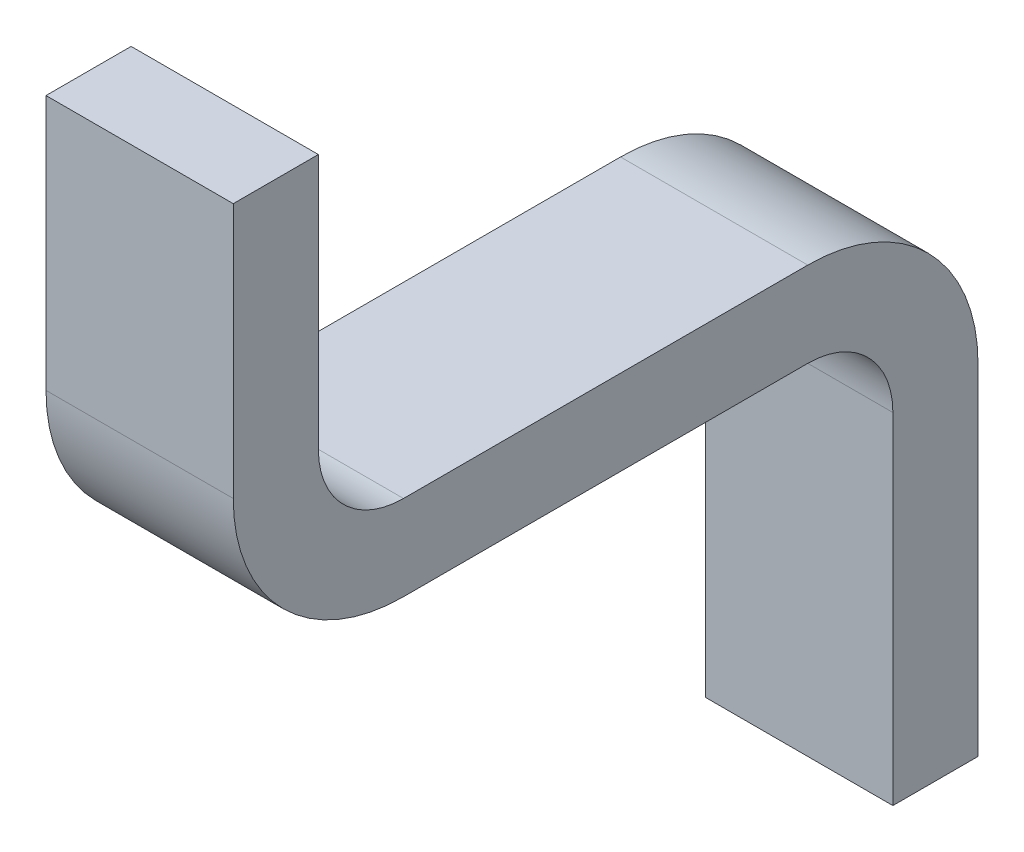
ISO-10303-21;
HEADER;
FILE_DESCRIPTION(('STEP AP214'),'2;1');
FILE_NAME('part.step','',(''),(''),'','','');
FILE_SCHEMA(('AUTOMOTIVE_DESIGN { 1 0 10303 214 1 1 1 1 }'));
ENDSEC;
DATA;
#1=APPLICATION_CONTEXT('core data for automotive mechanical design processes');
#2=APPLICATION_PROTOCOL_DEFINITION('international standard','automotive_design',2000,#1);
#3=PRODUCT_CONTEXT('',#1,'mechanical');
#4=PRODUCT('Part','Part','',(#3));
#5=PRODUCT_RELATED_PRODUCT_CATEGORY('part','',(#4));
#6=PRODUCT_DEFINITION_FORMATION('','',#4);
#7=PRODUCT_DEFINITION_CONTEXT('part definition',#1,'design');
#8=PRODUCT_DEFINITION('design','',#6,#7);
#9=PRODUCT_DEFINITION_SHAPE('','',#8);
#10=(LENGTH_UNIT() NAMED_UNIT(*) SI_UNIT(.MILLI.,.METRE.));
#11=(NAMED_UNIT(*) PLANE_ANGLE_UNIT() SI_UNIT($,.RADIAN.));
#12=(NAMED_UNIT(*) SI_UNIT($,.STERADIAN.) SOLID_ANGLE_UNIT());
#13=UNCERTAINTY_MEASURE_WITH_UNIT(LENGTH_MEASURE(1.E-05),#10,'distance_accuracy_value','');
#14=(GEOMETRIC_REPRESENTATION_CONTEXT(3) GLOBAL_UNCERTAINTY_ASSIGNED_CONTEXT((#13)) GLOBAL_UNIT_ASSIGNED_CONTEXT((#10,
#11,#12)) REPRESENTATION_CONTEXT('',''));
#15=CARTESIAN_POINT('',(0.,0.,0.));
#16=DIRECTION('',(0.,0.,1.));
#17=DIRECTION('',(1.,0.,0.));
#18=AXIS2_PLACEMENT_3D('',#15,#16,#17);
#19=CARTESIAN_POINT('',(-2.36,-4.,0.675));
#20=DIRECTION('',(1.,0.,0.));
#21=DIRECTION('',(0.,1.,0.));
#22=AXIS2_PLACEMENT_3D('',#19,#20,#21);
#23=PLANE('',#22);
#24=CARTESIAN_POINT('',(-2.36,-3.8,0.675));
#25=DIRECTION('',(-1.,0.,0.));
#26=DIRECTION('',(0.,-1.,0.));
#27=AXIS2_PLACEMENT_3D('',#24,#25,#26);
#28=CIRCLE('',#27,0.2);
#29=CARTESIAN_POINT('',(-2.36,-3.8,0.875));
#30=VERTEX_POINT('',#29);
#31=CARTESIAN_POINT('',(-2.36,-4.,0.675));
#32=VERTEX_POINT('',#31);
#33=EDGE_CURVE('E150',#30,#32,#28,.F.);
#34=ORIENTED_EDGE('',*,*,#33,.F.);
#35=DIRECTION('',(0.,1.,0.));
#36=VECTOR('',#35,1.);
#37=CARTESIAN_POINT('',(-2.36,-3.5,0.875));
#38=LINE('',#37,#36);
#39=CARTESIAN_POINT('',(-2.36,-3.5,0.875));
#40=VERTEX_POINT('',#39);
#41=EDGE_CURVE('E147',#30,#40,#38,.T.);
#42=ORIENTED_EDGE('',*,*,#41,.T.);
#43=DIRECTION('',(0.,0.,1.));
#44=VECTOR('',#43,1.);
#45=CARTESIAN_POINT('',(-2.36,-3.5,0.775));
#46=LINE('',#45,#44);
#47=CARTESIAN_POINT('',(-2.36,-3.5,0.775));
#48=VERTEX_POINT('',#47);
#49=EDGE_CURVE('E141',#48,#40,#46,.T.);
#50=ORIENTED_EDGE('',*,*,#49,.F.);
#51=DIRECTION('',(0.,1.,0.));
#52=VECTOR('',#51,1.);
#53=CARTESIAN_POINT('',(-2.36,-3.5,0.775));
#54=LINE('',#53,#52);
#55=CARTESIAN_POINT('',(-2.36,-3.8,0.775));
#56=VERTEX_POINT('',#55);
#57=EDGE_CURVE('E115',#48,#56,#54,.F.);
#58=ORIENTED_EDGE('',*,*,#57,.T.);
#59=CARTESIAN_POINT('',(-2.36,-3.8,0.675));
#60=DIRECTION('',(-1.,0.,0.));
#61=DIRECTION('',(0.,-1.,0.));
#62=AXIS2_PLACEMENT_3D('',#59,#60,#61);
#63=CIRCLE('',#62,0.1);
#64=CARTESIAN_POINT('',(-2.36,-3.9,0.675));
#65=VERTEX_POINT('',#64);
#66=EDGE_CURVE('E215',#56,#65,#63,.F.);
#67=ORIENTED_EDGE('',*,*,#66,.T.);
#68=DIRECTION('',(0.,0.,1.));
#69=VECTOR('',#68,1.);
#70=CARTESIAN_POINT('',(-2.36,-3.9,0.675));
#71=LINE('',#70,#69);
#72=CARTESIAN_POINT('',(-2.36,-3.9,0.2));
#73=VERTEX_POINT('',#72);
#74=EDGE_CURVE('E181',#65,#73,#71,.F.);
#75=ORIENTED_EDGE('',*,*,#74,.T.);
#76=CARTESIAN_POINT('',(-2.36,-4.1,0.2));
#77=DIRECTION('',(1.,0.,0.));
#78=DIRECTION('',(0.,1.,0.));
#79=AXIS2_PLACEMENT_3D('',#76,#77,#78);
#80=CIRCLE('',#79,0.2);
#81=CARTESIAN_POINT('',(-2.36,-4.1,0.));
#82=VERTEX_POINT('',#81);
#83=EDGE_CURVE('E20',#82,#73,#80,.T.);
#84=ORIENTED_EDGE('',*,*,#83,.F.);
#85=DIRECTION('',(0.,1.,0.));
#86=VECTOR('',#85,1.);
#87=CARTESIAN_POINT('',(-2.36,-4.1,0.));
#88=LINE('',#87,#86);
#89=CARTESIAN_POINT('',(-2.36,-4.5,0.));
#90=VERTEX_POINT('',#89);
#91=EDGE_CURVE('E91',#82,#90,#88,.F.);
#92=ORIENTED_EDGE('',*,*,#91,.T.);
#93=DIRECTION('',(0.,0.,1.));
#94=VECTOR('',#93,1.);
#95=CARTESIAN_POINT('',(-2.36,-4.5,0.));
#96=LINE('',#95,#94);
#97=CARTESIAN_POINT('',(-2.36,-4.5,0.1));
#98=VERTEX_POINT('',#97);
#99=EDGE_CURVE('E163',#90,#98,#96,.T.);
#100=ORIENTED_EDGE('',*,*,#99,.T.);
#101=DIRECTION('',(0.,1.,0.));
#102=VECTOR('',#101,1.);
#103=CARTESIAN_POINT('',(-2.36,-4.1,0.1));
#104=LINE('',#103,#102);
#105=CARTESIAN_POINT('',(-2.36,-4.1,0.1));
#106=VERTEX_POINT('',#105);
#107=EDGE_CURVE('E159',#98,#106,#104,.T.);
#108=ORIENTED_EDGE('',*,*,#107,.T.);
#109=CARTESIAN_POINT('',(-2.36,-4.1,0.2));
#110=DIRECTION('',(1.,0.,0.));
#111=DIRECTION('',(0.,1.,0.));
#112=AXIS2_PLACEMENT_3D('',#109,#110,#111);
#113=CIRCLE('',#112,0.1);
#114=CARTESIAN_POINT('',(-2.36,-4.,0.2));
#115=VERTEX_POINT('',#114);
#116=EDGE_CURVE('E155',#106,#115,#113,.T.);
#117=ORIENTED_EDGE('',*,*,#116,.T.);
#118=DIRECTION('',(0.,0.,1.));
#119=VECTOR('',#118,1.);
#120=CARTESIAN_POINT('',(-2.36,-4.,0.675));
#121=LINE('',#120,#119);
#122=EDGE_CURVE('E154',#115,#32,#121,.T.);
#123=ORIENTED_EDGE('',*,*,#122,.T.);
#124=EDGE_LOOP('',(#34,#42,#50,#58,#67,#75,#84,#92,#100,#108,#117,#123));
#125=FACE_BOUND('',#124,.T.);
#126=ADVANCED_FACE('F17',(#125),#23,.F.);
#127=CARTESIAN_POINT('',(-2.36,-4.1,0.2));
#128=DIRECTION('',(1.,0.,0.));
#129=DIRECTION('',(0.,1.,0.));
#130=AXIS2_PLACEMENT_3D('',#127,#128,#129);
#131=CYLINDRICAL_SURFACE('',#130,0.2);
#132=CARTESIAN_POINT('',(-2.14,-4.1,0.2));
#133=DIRECTION('',(1.,0.,0.));
#134=DIRECTION('',(0.,1.,0.));
#135=AXIS2_PLACEMENT_3D('',#132,#133,#134);
#136=CIRCLE('',#135,0.2);
#137=CARTESIAN_POINT('',(-2.14,-3.9,0.2));
#138=VERTEX_POINT('',#137);
#139=CARTESIAN_POINT('',(-2.14,-4.1,0.));
#140=VERTEX_POINT('',#139);
#141=EDGE_CURVE('E183',#138,#140,#136,.F.);
#142=ORIENTED_EDGE('',*,*,#141,.T.);
#143=DIRECTION('',(1.,0.,0.));
#144=VECTOR('',#143,1.);
#145=CARTESIAN_POINT('',(-2.36,-4.1,0.));
#146=LINE('',#145,#144);
#147=EDGE_CURVE('E178',#140,#82,#146,.F.);
#148=ORIENTED_EDGE('',*,*,#147,.T.);
#149=ORIENTED_EDGE('',*,*,#83,.T.);
#150=DIRECTION('',(1.,0.,0.));
#151=VECTOR('',#150,1.);
#152=CARTESIAN_POINT('',(-2.36,-3.9,0.2));
#153=LINE('',#152,#151);
#154=EDGE_CURVE('E217',#73,#138,#153,.T.);
#155=ORIENTED_EDGE('',*,*,#154,.T.);
#156=EDGE_LOOP('',(#142,#148,#149,#155));
#157=FACE_BOUND('',#156,.T.);
#158=ADVANCED_FACE('F254',(#157),#131,.T.);
#159=CARTESIAN_POINT('',(-2.36,-4.1,0.));
#160=DIRECTION('',(0.,0.,1.));
#161=DIRECTION('',(1.,0.,0.));
#162=AXIS2_PLACEMENT_3D('',#159,#160,#161);
#163=PLANE('',#162);
#164=ORIENTED_EDGE('',*,*,#147,.F.);
#165=DIRECTION('',(0.,-1.,0.));
#166=VECTOR('',#165,1.);
#167=CARTESIAN_POINT('',(-2.14,-3.9,0.));
#168=LINE('',#167,#166);
#169=CARTESIAN_POINT('',(-2.14,-4.5,0.));
#170=VERTEX_POINT('',#169);
#171=EDGE_CURVE('E170',#140,#170,#168,.T.);
#172=ORIENTED_EDGE('',*,*,#171,.T.);
#173=DIRECTION('',(-1.,0.,0.));
#174=VECTOR('',#173,1.);
#175=CARTESIAN_POINT('',(-2.36,-4.5,0.));
#176=LINE('',#175,#174);
#177=EDGE_CURVE('E173',#170,#90,#176,.T.);
#178=ORIENTED_EDGE('',*,*,#177,.T.);
#179=ORIENTED_EDGE('',*,*,#91,.F.);
#180=EDGE_LOOP('',(#164,#172,#178,#179));
#181=FACE_BOUND('',#180,.T.);
#182=ADVANCED_FACE('F257',(#181),#163,.F.);
#183=CARTESIAN_POINT('',(-2.36,-4.5,0.));
#184=DIRECTION('',(0.,1.,0.));
#185=DIRECTION('',(-1.,0.,0.));
#186=AXIS2_PLACEMENT_3D('',#183,#184,#185);
#187=PLANE('',#186);
#188=DIRECTION('',(-1.,0.,0.));
#189=VECTOR('',#188,1.);
#190=CARTESIAN_POINT('',(-2.14,-4.5,0.1));
#191=LINE('',#190,#189);
#192=CARTESIAN_POINT('',(-2.14,-4.5,0.1));
#193=VERTEX_POINT('',#192);
#194=EDGE_CURVE('E160',#193,#98,#191,.T.);
#195=ORIENTED_EDGE('',*,*,#194,.T.);
#196=ORIENTED_EDGE('',*,*,#99,.F.);
#197=ORIENTED_EDGE('',*,*,#177,.F.);
#198=DIRECTION('',(0.,0.,1.));
#199=VECTOR('',#198,1.);
#200=CARTESIAN_POINT('',(-2.14,-4.5,0.675));
#201=LINE('',#200,#199);
#202=EDGE_CURVE('E166',#170,#193,#201,.T.);
#203=ORIENTED_EDGE('',*,*,#202,.T.);
#204=EDGE_LOOP('',(#195,#196,#197,#203));
#205=FACE_BOUND('',#204,.T.);
#206=ADVANCED_FACE('F259',(#205),#187,.F.);
#207=CARTESIAN_POINT('',(-2.14,-4.1,0.1));
#208=DIRECTION('',(0.,0.,-1.));
#209=DIRECTION('',(-1.,0.,0.));
#210=AXIS2_PLACEMENT_3D('',#207,#208,#209);
#211=PLANE('',#210);
#212=DIRECTION('',(1.,0.,0.));
#213=VECTOR('',#212,1.);
#214=CARTESIAN_POINT('',(-2.14,-4.1,0.1));
#215=LINE('',#214,#213);
#216=CARTESIAN_POINT('',(-2.14,-4.1,0.1));
#217=VERTEX_POINT('',#216);
#218=EDGE_CURVE('E156',#217,#106,#215,.F.);
#219=ORIENTED_EDGE('',*,*,#218,.T.);
#220=ORIENTED_EDGE('',*,*,#107,.F.);
#221=ORIENTED_EDGE('',*,*,#194,.F.);
#222=DIRECTION('',(0.,-1.,0.));
#223=VECTOR('',#222,1.);
#224=CARTESIAN_POINT('',(-2.14,-3.9,0.1));
#225=LINE('',#224,#223);
#226=EDGE_CURVE('E169',#193,#217,#225,.F.);
#227=ORIENTED_EDGE('',*,*,#226,.T.);
#228=EDGE_LOOP('',(#219,#220,#221,#227));
#229=FACE_BOUND('',#228,.T.);
#230=ADVANCED_FACE('F234',(#229),#211,.F.);
#231=CARTESIAN_POINT('',(-2.14,-4.1,0.2));
#232=DIRECTION('',(1.,0.,0.));
#233=DIRECTION('',(0.,1.,0.));
#234=AXIS2_PLACEMENT_3D('',#231,#232,#233);
#235=CYLINDRICAL_SURFACE('',#234,0.1);
#236=DIRECTION('',(-1.,0.,0.));
#237=VECTOR('',#236,1.);
#238=CARTESIAN_POINT('',(-2.14,-4.,0.2));
#239=LINE('',#238,#237);
#240=CARTESIAN_POINT('',(-2.14,-4.,0.2));
#241=VERTEX_POINT('',#240);
#242=EDGE_CURVE('E151',#241,#115,#239,.T.);
#243=ORIENTED_EDGE('',*,*,#242,.T.);
#244=ORIENTED_EDGE('',*,*,#116,.F.);
#245=ORIENTED_EDGE('',*,*,#218,.F.);
#246=CARTESIAN_POINT('',(-2.14,-4.1,0.2));
#247=DIRECTION('',(1.,0.,0.));
#248=DIRECTION('',(0.,1.,0.));
#249=AXIS2_PLACEMENT_3D('',#246,#247,#248);
#250=CIRCLE('',#249,0.1);
#251=EDGE_CURVE('E210',#217,#241,#250,.T.);
#252=ORIENTED_EDGE('',*,*,#251,.T.);
#253=EDGE_LOOP('',(#243,#244,#245,#252));
#254=FACE_BOUND('',#253,.T.);
#255=ADVANCED_FACE('F227',(#254),#235,.F.);
#256=CARTESIAN_POINT('',(-2.14,-4.,0.675));
#257=DIRECTION('',(0.,1.,0.));
#258=DIRECTION('',(-1.,0.,0.));
#259=AXIS2_PLACEMENT_3D('',#256,#257,#258);
#260=PLANE('',#259);
#261=DIRECTION('',(-1.,0.,0.));
#262=VECTOR('',#261,1.);
#263=CARTESIAN_POINT('',(-2.14,-4.,0.675));
#264=LINE('',#263,#262);
#265=CARTESIAN_POINT('',(-2.14,-4.,0.675));
#266=VERTEX_POINT('',#265);
#267=EDGE_CURVE('E148',#32,#266,#264,.F.);
#268=ORIENTED_EDGE('',*,*,#267,.F.);
#269=ORIENTED_EDGE('',*,*,#122,.F.);
#270=ORIENTED_EDGE('',*,*,#242,.F.);
#271=DIRECTION('',(0.,0.,1.));
#272=VECTOR('',#271,1.);
#273=CARTESIAN_POINT('',(-2.14,-4.,0.675));
#274=LINE('',#273,#272);
#275=EDGE_CURVE('E209',#241,#266,#274,.T.);
#276=ORIENTED_EDGE('',*,*,#275,.T.);
#277=EDGE_LOOP('',(#268,#269,#270,#276));
#278=FACE_BOUND('',#277,.T.);
#279=ADVANCED_FACE('F224',(#278),#260,.F.);
#280=CARTESIAN_POINT('',(-2.14,-3.8,0.675));
#281=DIRECTION('',(-1.,0.,0.));
#282=DIRECTION('',(0.,-1.,0.));
#283=AXIS2_PLACEMENT_3D('',#280,#281,#282);
#284=CYLINDRICAL_SURFACE('',#283,0.2);
#285=ORIENTED_EDGE('',*,*,#33,.T.);
#286=ORIENTED_EDGE('',*,*,#267,.T.);
#287=CARTESIAN_POINT('',(-2.14,-3.8,0.675));
#288=DIRECTION('',(-1.,0.,0.));
#289=DIRECTION('',(0.,-1.,0.));
#290=AXIS2_PLACEMENT_3D('',#287,#288,#289);
#291=CIRCLE('',#290,0.2);
#292=CARTESIAN_POINT('',(-2.14,-3.8,0.875));
#293=VERTEX_POINT('',#292);
#294=EDGE_CURVE('E133',#266,#293,#291,.T.);
#295=ORIENTED_EDGE('',*,*,#294,.T.);
#296=DIRECTION('',(-1.,0.,0.));
#297=VECTOR('',#296,1.);
#298=CARTESIAN_POINT('',(-2.14,-3.8,0.875));
#299=LINE('',#298,#297);
#300=EDGE_CURVE('E144',#293,#30,#299,.T.);
#301=ORIENTED_EDGE('',*,*,#300,.T.);
#302=EDGE_LOOP('',(#285,#286,#295,#301));
#303=FACE_BOUND('',#302,.T.);
#304=ADVANCED_FACE('F285',(#303),#284,.T.);
#305=CARTESIAN_POINT('',(-2.14,-3.5,0.875));
#306=DIRECTION('',(0.,0.,-1.));
#307=DIRECTION('',(-1.,0.,0.));
#308=AXIS2_PLACEMENT_3D('',#305,#306,#307);
#309=PLANE('',#308);
#310=DIRECTION('',(-1.,0.,0.));
#311=VECTOR('',#310,1.);
#312=CARTESIAN_POINT('',(-2.36,-3.5,0.875));
#313=LINE('',#312,#311);
#314=CARTESIAN_POINT('',(-2.14,-3.5,0.875));
#315=VERTEX_POINT('',#314);
#316=EDGE_CURVE('E118',#40,#315,#313,.F.);
#317=ORIENTED_EDGE('',*,*,#316,.F.);
#318=ORIENTED_EDGE('',*,*,#41,.F.);
#319=ORIENTED_EDGE('',*,*,#300,.F.);
#320=DIRECTION('',(0.,-1.,0.));
#321=VECTOR('',#320,1.);
#322=CARTESIAN_POINT('',(-2.14,-3.9,0.875));
#323=LINE('',#322,#321);
#324=EDGE_CURVE('E131',#293,#315,#323,.F.);
#325=ORIENTED_EDGE('',*,*,#324,.T.);
#326=EDGE_LOOP('',(#317,#318,#319,#325));
#327=FACE_BOUND('',#326,.T.);
#328=ADVANCED_FACE('F282',(#327),#309,.F.);
#329=CARTESIAN_POINT('',(-2.36,-3.5,0.775));
#330=DIRECTION('',(0.,1.,0.));
#331=DIRECTION('',(-1.,0.,0.));
#332=AXIS2_PLACEMENT_3D('',#329,#330,#331);
#333=PLANE('',#332);
#334=ORIENTED_EDGE('',*,*,#49,.T.);
#335=ORIENTED_EDGE('',*,*,#316,.T.);
#336=DIRECTION('',(0.,0.,1.));
#337=VECTOR('',#336,1.);
#338=CARTESIAN_POINT('',(-2.14,-3.5,0.675));
#339=LINE('',#338,#337);
#340=CARTESIAN_POINT('',(-2.14,-3.5,0.775));
#341=VERTEX_POINT('',#340);
#342=EDGE_CURVE('E125',#315,#341,#339,.F.);
#343=ORIENTED_EDGE('',*,*,#342,.T.);
#344=DIRECTION('',(1.,0.,0.));
#345=VECTOR('',#344,1.);
#346=CARTESIAN_POINT('',(-2.36,-3.5,0.775));
#347=LINE('',#346,#345);
#348=EDGE_CURVE('E110',#341,#48,#347,.F.);
#349=ORIENTED_EDGE('',*,*,#348,.T.);
#350=EDGE_LOOP('',(#334,#335,#343,#349));
#351=FACE_BOUND('',#350,.T.);
#352=ADVANCED_FACE('F129',(#351),#333,.T.);
#353=CARTESIAN_POINT('',(-2.36,-3.5,0.775));
#354=DIRECTION('',(0.,0.,1.));
#355=DIRECTION('',(1.,0.,0.));
#356=AXIS2_PLACEMENT_3D('',#353,#354,#355);
#357=PLANE('',#356);
#358=ORIENTED_EDGE('',*,*,#348,.F.);
#359=DIRECTION('',(0.,-1.,0.));
#360=VECTOR('',#359,1.);
#361=CARTESIAN_POINT('',(-2.14,-3.9,0.775));
#362=LINE('',#361,#360);
#363=CARTESIAN_POINT('',(-2.14,-3.8,0.775));
#364=VERTEX_POINT('',#363);
#365=EDGE_CURVE('E114',#341,#364,#362,.T.);
#366=ORIENTED_EDGE('',*,*,#365,.T.);
#367=DIRECTION('',(-1.,0.,0.));
#368=VECTOR('',#367,1.);
#369=CARTESIAN_POINT('',(-2.36,-3.8,0.775));
#370=LINE('',#369,#368);
#371=EDGE_CURVE('E185',#364,#56,#370,.T.);
#372=ORIENTED_EDGE('',*,*,#371,.T.);
#373=ORIENTED_EDGE('',*,*,#57,.F.);
#374=EDGE_LOOP('',(#358,#366,#372,#373));
#375=FACE_BOUND('',#374,.T.);
#376=ADVANCED_FACE('F112',(#375),#357,.F.);
#377=CARTESIAN_POINT('',(-2.36,-3.8,0.675));
#378=DIRECTION('',(-1.,0.,0.));
#379=DIRECTION('',(0.,-1.,0.));
#380=AXIS2_PLACEMENT_3D('',#377,#378,#379);
#381=CYLINDRICAL_SURFACE('',#380,0.1);
#382=ORIENTED_EDGE('',*,*,#371,.F.);
#383=CARTESIAN_POINT('',(-2.14,-3.8,0.675));
#384=DIRECTION('',(-1.,0.,0.));
#385=DIRECTION('',(0.,-1.,0.));
#386=AXIS2_PLACEMENT_3D('',#383,#384,#385);
#387=CIRCLE('',#386,0.1);
#388=CARTESIAN_POINT('',(-2.14,-3.9,0.675));
#389=VERTEX_POINT('',#388);
#390=EDGE_CURVE('E26',#364,#389,#387,.F.);
#391=ORIENTED_EDGE('',*,*,#390,.T.);
#392=DIRECTION('',(1.,0.,0.));
#393=VECTOR('',#392,1.);
#394=CARTESIAN_POINT('',(-2.36,-3.9,0.675));
#395=LINE('',#394,#393);
#396=EDGE_CURVE('E34',#389,#65,#395,.F.);
#397=ORIENTED_EDGE('',*,*,#396,.T.);
#398=ORIENTED_EDGE('',*,*,#66,.F.);
#399=EDGE_LOOP('',(#382,#391,#397,#398));
#400=FACE_BOUND('',#399,.T.);
#401=ADVANCED_FACE('F250',(#400),#381,.F.);
#402=CARTESIAN_POINT('',(-2.36,-3.9,0.675));
#403=DIRECTION('',(0.,-1.,0.));
#404=DIRECTION('',(1.,0.,0.));
#405=AXIS2_PLACEMENT_3D('',#402,#403,#404);
#406=PLANE('',#405);
#407=ORIENTED_EDGE('',*,*,#396,.F.);
#408=DIRECTION('',(0.,0.,1.));
#409=VECTOR('',#408,1.);
#410=CARTESIAN_POINT('',(-2.14,-3.9,0.675));
#411=LINE('',#410,#409);
#412=EDGE_CURVE('E11',#389,#138,#411,.F.);
#413=ORIENTED_EDGE('',*,*,#412,.T.);
#414=ORIENTED_EDGE('',*,*,#154,.F.);
#415=ORIENTED_EDGE('',*,*,#74,.F.);
#416=EDGE_LOOP('',(#407,#413,#414,#415));
#417=FACE_BOUND('',#416,.T.);
#418=ADVANCED_FACE('F252',(#417),#406,.F.);
#419=CARTESIAN_POINT('',(-2.14,-3.9,0.675));
#420=DIRECTION('',(-1.,0.,0.));
#421=DIRECTION('',(0.,-1.,0.));
#422=AXIS2_PLACEMENT_3D('',#419,#420,#421);
#423=PLANE('',#422);
#424=ORIENTED_EDGE('',*,*,#390,.F.);
#425=ORIENTED_EDGE('',*,*,#365,.F.);
#426=ORIENTED_EDGE('',*,*,#342,.F.);
#427=ORIENTED_EDGE('',*,*,#324,.F.);
#428=ORIENTED_EDGE('',*,*,#294,.F.);
#429=ORIENTED_EDGE('',*,*,#275,.F.);
#430=ORIENTED_EDGE('',*,*,#251,.F.);
#431=ORIENTED_EDGE('',*,*,#226,.F.);
#432=ORIENTED_EDGE('',*,*,#202,.F.);
#433=ORIENTED_EDGE('',*,*,#171,.F.);
#434=ORIENTED_EDGE('',*,*,#141,.F.);
#435=ORIENTED_EDGE('',*,*,#412,.F.);
#436=EDGE_LOOP('',(#424,#425,#426,#427,#428,#429,#430,#431,#432,#433,#434,#435));
#437=FACE_BOUND('',#436,.T.);
#438=ADVANCED_FACE('F123',(#437),#423,.F.);
#439=CLOSED_SHELL('',(#126,#158,#182,#206,#230,#255,#279,#304,#328,#352,#376,#401,#418,#438));
#440=MANIFOLD_SOLID_BREP('B1',#439);
#441=ADVANCED_BREP_SHAPE_REPRESENTATION('',(#18,#440),#14);
#442=SHAPE_DEFINITION_REPRESENTATION(#9,#441);
ENDSEC;
END-ISO-10303-21;
